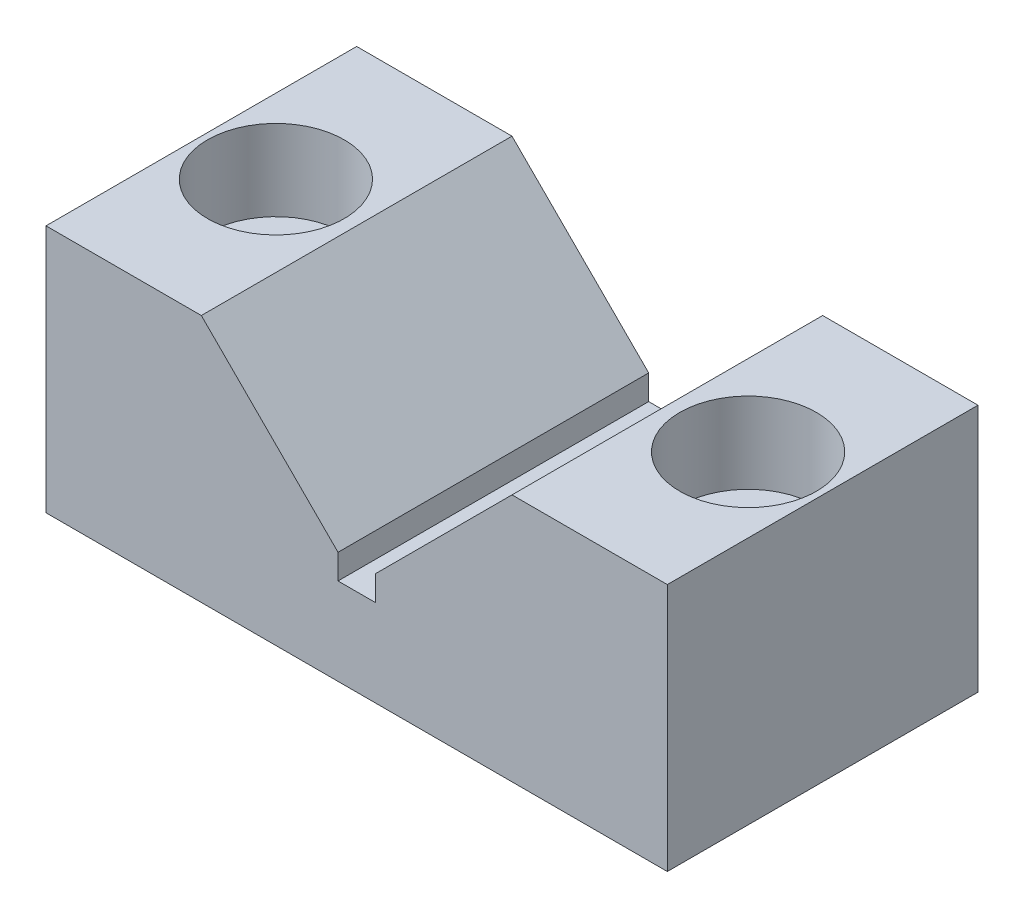
ISO-10303-21;
HEADER;
FILE_DESCRIPTION(('STEP AP214'),'2;1');
FILE_NAME('part.step','',(''),(''),'','','');
FILE_SCHEMA(('AUTOMOTIVE_DESIGN { 1 0 10303 214 1 1 1 1 }'));
ENDSEC;
DATA;
#1=APPLICATION_CONTEXT('core data for automotive mechanical design processes');
#2=APPLICATION_PROTOCOL_DEFINITION('international standard','automotive_design',2000,#1);
#3=PRODUCT_CONTEXT('',#1,'mechanical');
#4=PRODUCT('Part','Part','',(#3));
#5=PRODUCT_RELATED_PRODUCT_CATEGORY('part','',(#4));
#6=PRODUCT_DEFINITION_FORMATION('','',#4);
#7=PRODUCT_DEFINITION_CONTEXT('part definition',#1,'design');
#8=PRODUCT_DEFINITION('design','',#6,#7);
#9=PRODUCT_DEFINITION_SHAPE('','',#8);
#10=(LENGTH_UNIT() NAMED_UNIT(*) SI_UNIT(.MILLI.,.METRE.));
#11=(NAMED_UNIT(*) PLANE_ANGLE_UNIT() SI_UNIT($,.RADIAN.));
#12=(NAMED_UNIT(*) SI_UNIT($,.STERADIAN.) SOLID_ANGLE_UNIT());
#13=UNCERTAINTY_MEASURE_WITH_UNIT(LENGTH_MEASURE(1.E-05),#10,'distance_accuracy_value','');
#14=(GEOMETRIC_REPRESENTATION_CONTEXT(3) GLOBAL_UNCERTAINTY_ASSIGNED_CONTEXT((#13)) GLOBAL_UNIT_ASSIGNED_CONTEXT((#10,
#11,#12)) REPRESENTATION_CONTEXT('',''));
#15=CARTESIAN_POINT('',(0.,0.,0.));
#16=DIRECTION('',(0.,0.,1.));
#17=DIRECTION('',(1.,0.,0.));
#18=AXIS2_PLACEMENT_3D('',#15,#16,#17);
#19=CARTESIAN_POINT('',(19.,0.,0.));
#20=DIRECTION('',(0.,1.,0.));
#21=DIRECTION('',(-1.,0.,0.));
#22=AXIS2_PLACEMENT_3D('',#19,#20,#21);
#23=CYLINDRICAL_SURFACE('',#22,3.25);
#24=CARTESIAN_POINT('',(19.,0.,0.));
#25=DIRECTION('',(0.,1.,0.));
#26=DIRECTION('',(-1.,0.,0.));
#27=AXIS2_PLACEMENT_3D('',#24,#25,#26);
#28=CIRCLE('',#27,3.25);
#29=CARTESIAN_POINT('',(15.75,0.,0.));
#30=VERTEX_POINT('',#29);
#31=EDGE_CURVE('E132',#30,#30,#28,.T.);
#32=ORIENTED_EDGE('',*,*,#31,.F.);
#33=EDGE_LOOP('',(#32));
#34=FACE_BOUND('',#33,.T.);
#35=CARTESIAN_POINT('',(19.,13.5,0.));
#36=DIRECTION('',(0.,1.,0.));
#37=DIRECTION('',(-1.,0.,0.));
#38=AXIS2_PLACEMENT_3D('',#35,#36,#37);
#39=CIRCLE('',#38,3.25);
#40=CARTESIAN_POINT('',(15.75,13.5,0.));
#41=VERTEX_POINT('',#40);
#42=EDGE_CURVE('E35',#41,#41,#39,.F.);
#43=ORIENTED_EDGE('',*,*,#42,.F.);
#44=EDGE_LOOP('',(#43));
#45=FACE_BOUND('',#44,.T.);
#46=ADVANCED_FACE('F31',(#34,#45),#23,.F.);
#47=CARTESIAN_POINT('',(-19.,0.,0.));
#48=DIRECTION('',(0.,1.,0.));
#49=DIRECTION('',(-1.,0.,0.));
#50=AXIS2_PLACEMENT_3D('',#47,#48,#49);
#51=CYLINDRICAL_SURFACE('',#50,3.25);
#52=CARTESIAN_POINT('',(-19.,0.,0.));
#53=DIRECTION('',(0.,1.,0.));
#54=DIRECTION('',(-1.,0.,0.));
#55=AXIS2_PLACEMENT_3D('',#52,#53,#54);
#56=CIRCLE('',#55,3.25);
#57=CARTESIAN_POINT('',(-22.25,0.,0.));
#58=VERTEX_POINT('',#57);
#59=EDGE_CURVE('E129',#58,#58,#56,.T.);
#60=ORIENTED_EDGE('',*,*,#59,.F.);
#61=EDGE_LOOP('',(#60));
#62=FACE_BOUND('',#61,.T.);
#63=CARTESIAN_POINT('',(-19.,13.5,0.));
#64=DIRECTION('',(0.,1.,0.));
#65=DIRECTION('',(-1.,0.,0.));
#66=AXIS2_PLACEMENT_3D('',#63,#64,#65);
#67=CIRCLE('',#66,3.25);
#68=CARTESIAN_POINT('',(-22.25,13.5,0.));
#69=VERTEX_POINT('',#68);
#70=EDGE_CURVE('E192',#69,#69,#67,.F.);
#71=ORIENTED_EDGE('',*,*,#70,.F.);
#72=EDGE_LOOP('',(#71));
#73=FACE_BOUND('',#72,.T.);
#74=ADVANCED_FACE('F219',(#62,#73),#51,.F.);
#75=CARTESIAN_POINT('',(25.,0.,-12.5));
#76=DIRECTION('',(1.,0.,0.));
#77=DIRECTION('',(0.,1.,0.));
#78=AXIS2_PLACEMENT_3D('',#75,#76,#77);
#79=PLANE('',#78);
#80=DIRECTION('',(0.,0.,1.));
#81=VECTOR('',#80,1.);
#82=CARTESIAN_POINT('',(25.,20.,-12.5));
#83=LINE('',#82,#81);
#84=CARTESIAN_POINT('',(25.,20.,-12.5));
#85=VERTEX_POINT('',#84);
#86=CARTESIAN_POINT('',(25.,20.,12.5));
#87=VERTEX_POINT('',#86);
#88=EDGE_CURVE('E106',#85,#87,#83,.T.);
#89=ORIENTED_EDGE('',*,*,#88,.T.);
#90=DIRECTION('',(0.,1.,0.));
#91=VECTOR('',#90,1.);
#92=CARTESIAN_POINT('',(25.,0.,12.5));
#93=LINE('',#92,#91);
#94=CARTESIAN_POINT('',(25.,0.,12.5));
#95=VERTEX_POINT('',#94);
#96=EDGE_CURVE('E109',#95,#87,#93,.T.);
#97=ORIENTED_EDGE('',*,*,#96,.F.);
#98=DIRECTION('',(0.,0.,1.));
#99=VECTOR('',#98,1.);
#100=CARTESIAN_POINT('',(25.,0.,-12.5));
#101=LINE('',#100,#99);
#102=CARTESIAN_POINT('',(25.,0.,-12.5));
#103=VERTEX_POINT('',#102);
#104=EDGE_CURVE('E11',#103,#95,#101,.T.);
#105=ORIENTED_EDGE('',*,*,#104,.F.);
#106=DIRECTION('',(0.,1.,0.));
#107=VECTOR('',#106,1.);
#108=CARTESIAN_POINT('',(25.,0.,-12.5));
#109=LINE('',#108,#107);
#110=EDGE_CURVE('E110',#103,#85,#109,.T.);
#111=ORIENTED_EDGE('',*,*,#110,.T.);
#112=EDGE_LOOP('',(#89,#97,#105,#111));
#113=FACE_BOUND('',#112,.T.);
#114=ADVANCED_FACE('F33',(#113),#79,.T.);
#115=CARTESIAN_POINT('',(-25.,0.,-12.5));
#116=DIRECTION('',(0.,-1.,0.));
#117=DIRECTION('',(0.,0.,-1.));
#118=AXIS2_PLACEMENT_3D('',#115,#116,#117);
#119=PLANE('',#118);
#120=ORIENTED_EDGE('',*,*,#31,.T.);
#121=EDGE_LOOP('',(#120));
#122=FACE_BOUND('',#121,.T.);
#123=ORIENTED_EDGE('',*,*,#59,.T.);
#124=EDGE_LOOP('',(#123));
#125=FACE_BOUND('',#124,.T.);
#126=ORIENTED_EDGE('',*,*,#104,.T.);
#127=DIRECTION('',(1.,0.,0.));
#128=VECTOR('',#127,1.);
#129=CARTESIAN_POINT('',(-25.,0.,12.5));
#130=LINE('',#129,#128);
#131=CARTESIAN_POINT('',(-25.,0.,12.5));
#132=VERTEX_POINT('',#131);
#133=EDGE_CURVE('E128',#132,#95,#130,.T.);
#134=ORIENTED_EDGE('',*,*,#133,.F.);
#135=DIRECTION('',(0.,0.,1.));
#136=VECTOR('',#135,1.);
#137=CARTESIAN_POINT('',(-25.,0.,-12.5));
#138=LINE('',#137,#136);
#139=CARTESIAN_POINT('',(-25.,0.,-12.5));
#140=VERTEX_POINT('',#139);
#141=EDGE_CURVE('E40',#140,#132,#138,.T.);
#142=ORIENTED_EDGE('',*,*,#141,.F.);
#143=DIRECTION('',(1.,0.,0.));
#144=VECTOR('',#143,1.);
#145=CARTESIAN_POINT('',(-25.,0.,-12.5));
#146=LINE('',#145,#144);
#147=EDGE_CURVE('E115',#140,#103,#146,.T.);
#148=ORIENTED_EDGE('',*,*,#147,.T.);
#149=EDGE_LOOP('',(#126,#134,#142,#148));
#150=FACE_BOUND('',#149,.T.);
#151=ADVANCED_FACE('F239',(#122,#125,#150),#119,.T.);
#152=CARTESIAN_POINT('',(-25.,20.,-12.5));
#153=DIRECTION('',(-1.,0.,0.));
#154=DIRECTION('',(0.,-1.,0.));
#155=AXIS2_PLACEMENT_3D('',#152,#153,#154);
#156=PLANE('',#155);
#157=ORIENTED_EDGE('',*,*,#141,.T.);
#158=DIRECTION('',(0.,-1.,0.));
#159=VECTOR('',#158,1.);
#160=CARTESIAN_POINT('',(-25.,20.,12.5));
#161=LINE('',#160,#159);
#162=CARTESIAN_POINT('',(-25.,20.,12.5));
#163=VERTEX_POINT('',#162);
#164=EDGE_CURVE('E152',#163,#132,#161,.T.);
#165=ORIENTED_EDGE('',*,*,#164,.F.);
#166=DIRECTION('',(0.,0.,1.));
#167=VECTOR('',#166,1.);
#168=CARTESIAN_POINT('',(-25.,20.,-12.5));
#169=LINE('',#168,#167);
#170=CARTESIAN_POINT('',(-25.,20.,-12.5));
#171=VERTEX_POINT('',#170);
#172=EDGE_CURVE('E180',#171,#163,#169,.T.);
#173=ORIENTED_EDGE('',*,*,#172,.F.);
#174=DIRECTION('',(0.,-1.,0.));
#175=VECTOR('',#174,1.);
#176=CARTESIAN_POINT('',(-25.,20.,-12.5));
#177=LINE('',#176,#175);
#178=EDGE_CURVE('E176',#171,#140,#177,.T.);
#179=ORIENTED_EDGE('',*,*,#178,.T.);
#180=EDGE_LOOP('',(#157,#165,#173,#179));
#181=FACE_BOUND('',#180,.T.);
#182=ADVANCED_FACE('F242',(#181),#156,.T.);
#183=CARTESIAN_POINT('',(-12.5,20.,-12.5));
#184=DIRECTION('',(0.,1.,0.));
#185=DIRECTION('',(-1.,0.,0.));
#186=AXIS2_PLACEMENT_3D('',#183,#184,#185);
#187=PLANE('',#186);
#188=CARTESIAN_POINT('',(-19.,20.,0.));
#189=DIRECTION('',(0.,1.,0.));
#190=DIRECTION('',(-1.,0.,0.));
#191=AXIS2_PLACEMENT_3D('',#188,#189,#190);
#192=CIRCLE('',#191,5.5);
#193=CARTESIAN_POINT('',(-24.5,20.,0.));
#194=VERTEX_POINT('',#193);
#195=EDGE_CURVE('E199',#194,#194,#192,.T.);
#196=ORIENTED_EDGE('',*,*,#195,.F.);
#197=EDGE_LOOP('',(#196));
#198=FACE_BOUND('',#197,.T.);
#199=ORIENTED_EDGE('',*,*,#172,.T.);
#200=DIRECTION('',(-1.,0.,0.));
#201=VECTOR('',#200,1.);
#202=CARTESIAN_POINT('',(-12.5,20.,12.5));
#203=LINE('',#202,#201);
#204=CARTESIAN_POINT('',(-12.5,20.,12.5));
#205=VERTEX_POINT('',#204);
#206=EDGE_CURVE('E149',#205,#163,#203,.T.);
#207=ORIENTED_EDGE('',*,*,#206,.F.);
#208=DIRECTION('',(0.,0.,1.));
#209=VECTOR('',#208,1.);
#210=CARTESIAN_POINT('',(-12.5,20.,-12.5));
#211=LINE('',#210,#209);
#212=CARTESIAN_POINT('',(-12.5,20.,-12.5));
#213=VERTEX_POINT('',#212);
#214=EDGE_CURVE('E182',#213,#205,#211,.T.);
#215=ORIENTED_EDGE('',*,*,#214,.F.);
#216=DIRECTION('',(-1.,0.,0.));
#217=VECTOR('',#216,1.);
#218=CARTESIAN_POINT('',(-12.5,20.,-12.5));
#219=LINE('',#218,#217);
#220=EDGE_CURVE('E173',#213,#171,#219,.T.);
#221=ORIENTED_EDGE('',*,*,#220,.T.);
#222=EDGE_LOOP('',(#199,#207,#215,#221));
#223=FACE_BOUND('',#222,.T.);
#224=ADVANCED_FACE('F246',(#198,#223),#187,.T.);
#225=CARTESIAN_POINT('',(-1.5,9.,-12.5));
#226=DIRECTION('',(0.707106781186547,0.707106781186548,0.));
#227=DIRECTION('',(-0.707106781186548,0.707106781186547,0.));
#228=AXIS2_PLACEMENT_3D('',#225,#226,#227);
#229=PLANE('',#228);
#230=ORIENTED_EDGE('',*,*,#214,.T.);
#231=DIRECTION('',(-0.707106781186548,0.707106781186547,0.));
#232=VECTOR('',#231,1.);
#233=CARTESIAN_POINT('',(-1.5,9.,12.5));
#234=LINE('',#233,#232);
#235=CARTESIAN_POINT('',(-1.5,9.,12.5));
#236=VERTEX_POINT('',#235);
#237=EDGE_CURVE('E146',#236,#205,#234,.T.);
#238=ORIENTED_EDGE('',*,*,#237,.F.);
#239=DIRECTION('',(0.,0.,1.));
#240=VECTOR('',#239,1.);
#241=CARTESIAN_POINT('',(-1.5,9.,-12.5));
#242=LINE('',#241,#240);
#243=CARTESIAN_POINT('',(-1.5,9.,-12.5));
#244=VERTEX_POINT('',#243);
#245=EDGE_CURVE('E184',#244,#236,#242,.T.);
#246=ORIENTED_EDGE('',*,*,#245,.F.);
#247=DIRECTION('',(-0.707106781186548,0.707106781186547,0.));
#248=VECTOR('',#247,1.);
#249=CARTESIAN_POINT('',(-1.5,9.,-12.5));
#250=LINE('',#249,#248);
#251=EDGE_CURVE('E170',#244,#213,#250,.T.);
#252=ORIENTED_EDGE('',*,*,#251,.T.);
#253=EDGE_LOOP('',(#230,#238,#246,#252));
#254=FACE_BOUND('',#253,.T.);
#255=ADVANCED_FACE('F250',(#254),#229,.T.);
#256=CARTESIAN_POINT('',(-1.5,7.,-12.5));
#257=DIRECTION('',(1.,0.,0.));
#258=DIRECTION('',(0.,0.,-1.));
#259=AXIS2_PLACEMENT_3D('',#256,#257,#258);
#260=PLANE('',#259);
#261=ORIENTED_EDGE('',*,*,#245,.T.);
#262=DIRECTION('',(0.,1.,0.));
#263=VECTOR('',#262,1.);
#264=CARTESIAN_POINT('',(-1.5,7.,12.5));
#265=LINE('',#264,#263);
#266=CARTESIAN_POINT('',(-1.5,7.,12.5));
#267=VERTEX_POINT('',#266);
#268=EDGE_CURVE('E143',#267,#236,#265,.T.);
#269=ORIENTED_EDGE('',*,*,#268,.F.);
#270=DIRECTION('',(0.,0.,1.));
#271=VECTOR('',#270,1.);
#272=CARTESIAN_POINT('',(-1.5,7.,-12.5));
#273=LINE('',#272,#271);
#274=CARTESIAN_POINT('',(-1.5,7.,-12.5));
#275=VERTEX_POINT('',#274);
#276=EDGE_CURVE('E186',#275,#267,#273,.T.);
#277=ORIENTED_EDGE('',*,*,#276,.F.);
#278=DIRECTION('',(0.,1.,0.));
#279=VECTOR('',#278,1.);
#280=CARTESIAN_POINT('',(-1.5,7.,-12.5));
#281=LINE('',#280,#279);
#282=EDGE_CURVE('E167',#275,#244,#281,.T.);
#283=ORIENTED_EDGE('',*,*,#282,.T.);
#284=EDGE_LOOP('',(#261,#269,#277,#283));
#285=FACE_BOUND('',#284,.T.);
#286=ADVANCED_FACE('F254',(#285),#260,.T.);
#287=CARTESIAN_POINT('',(1.5,7.,-12.5));
#288=DIRECTION('',(0.,1.,0.));
#289=DIRECTION('',(0.,0.,1.));
#290=AXIS2_PLACEMENT_3D('',#287,#288,#289);
#291=PLANE('',#290);
#292=ORIENTED_EDGE('',*,*,#276,.T.);
#293=DIRECTION('',(-1.,0.,0.));
#294=VECTOR('',#293,1.);
#295=CARTESIAN_POINT('',(1.5,7.,12.5));
#296=LINE('',#295,#294);
#297=CARTESIAN_POINT('',(1.5,7.,12.5));
#298=VERTEX_POINT('',#297);
#299=EDGE_CURVE('E140',#298,#267,#296,.T.);
#300=ORIENTED_EDGE('',*,*,#299,.F.);
#301=DIRECTION('',(0.,0.,1.));
#302=VECTOR('',#301,1.);
#303=CARTESIAN_POINT('',(1.5,7.,-12.5));
#304=LINE('',#303,#302);
#305=CARTESIAN_POINT('',(1.5,7.,-12.5));
#306=VERTEX_POINT('',#305);
#307=EDGE_CURVE('E188',#306,#298,#304,.T.);
#308=ORIENTED_EDGE('',*,*,#307,.F.);
#309=DIRECTION('',(-1.,0.,0.));
#310=VECTOR('',#309,1.);
#311=CARTESIAN_POINT('',(1.5,7.,-12.5));
#312=LINE('',#311,#310);
#313=EDGE_CURVE('E164',#306,#275,#312,.T.);
#314=ORIENTED_EDGE('',*,*,#313,.T.);
#315=EDGE_LOOP('',(#292,#300,#308,#314));
#316=FACE_BOUND('',#315,.T.);
#317=ADVANCED_FACE('F258',(#316),#291,.T.);
#318=CARTESIAN_POINT('',(1.5,9.,-12.5));
#319=DIRECTION('',(-1.,0.,0.));
#320=DIRECTION('',(0.,0.,1.));
#321=AXIS2_PLACEMENT_3D('',#318,#319,#320);
#322=PLANE('',#321);
#323=ORIENTED_EDGE('',*,*,#307,.T.);
#324=DIRECTION('',(0.,-1.,0.));
#325=VECTOR('',#324,1.);
#326=CARTESIAN_POINT('',(1.5,9.,12.5));
#327=LINE('',#326,#325);
#328=CARTESIAN_POINT('',(1.5,9.,12.5));
#329=VERTEX_POINT('',#328);
#330=EDGE_CURVE('E137',#329,#298,#327,.T.);
#331=ORIENTED_EDGE('',*,*,#330,.F.);
#332=DIRECTION('',(0.,0.,1.));
#333=VECTOR('',#332,1.);
#334=CARTESIAN_POINT('',(1.5,9.,-12.5));
#335=LINE('',#334,#333);
#336=CARTESIAN_POINT('',(1.5,9.,-12.5));
#337=VERTEX_POINT('',#336);
#338=EDGE_CURVE('E190',#337,#329,#335,.T.);
#339=ORIENTED_EDGE('',*,*,#338,.F.);
#340=DIRECTION('',(0.,-1.,0.));
#341=VECTOR('',#340,1.);
#342=CARTESIAN_POINT('',(1.5,9.,-12.5));
#343=LINE('',#342,#341);
#344=EDGE_CURVE('E161',#337,#306,#343,.T.);
#345=ORIENTED_EDGE('',*,*,#344,.T.);
#346=EDGE_LOOP('',(#323,#331,#339,#345));
#347=FACE_BOUND('',#346,.T.);
#348=ADVANCED_FACE('F262',(#347),#322,.T.);
#349=CARTESIAN_POINT('',(12.5,20.,-12.5));
#350=DIRECTION('',(-0.707106781186547,0.707106781186548,0.));
#351=DIRECTION('',(-0.707106781186548,-0.707106781186547,0.));
#352=AXIS2_PLACEMENT_3D('',#349,#350,#351);
#353=PLANE('',#352);
#354=ORIENTED_EDGE('',*,*,#338,.T.);
#355=DIRECTION('',(-0.707106781186548,-0.707106781186547,0.));
#356=VECTOR('',#355,1.);
#357=CARTESIAN_POINT('',(12.5,20.,12.5));
#358=LINE('',#357,#356);
#359=CARTESIAN_POINT('',(12.5,20.,12.5));
#360=VERTEX_POINT('',#359);
#361=EDGE_CURVE('E123',#360,#329,#358,.T.);
#362=ORIENTED_EDGE('',*,*,#361,.F.);
#363=DIRECTION('',(0.,0.,1.));
#364=VECTOR('',#363,1.);
#365=CARTESIAN_POINT('',(12.5,20.,-12.5));
#366=LINE('',#365,#364);
#367=CARTESIAN_POINT('',(12.5,20.,-12.5));
#368=VERTEX_POINT('',#367);
#369=EDGE_CURVE('E114',#368,#360,#366,.T.);
#370=ORIENTED_EDGE('',*,*,#369,.F.);
#371=DIRECTION('',(-0.707106781186548,-0.707106781186547,0.));
#372=VECTOR('',#371,1.);
#373=CARTESIAN_POINT('',(12.5,20.,-12.5));
#374=LINE('',#373,#372);
#375=EDGE_CURVE('E158',#368,#337,#374,.T.);
#376=ORIENTED_EDGE('',*,*,#375,.T.);
#377=EDGE_LOOP('',(#354,#362,#370,#376));
#378=FACE_BOUND('',#377,.T.);
#379=ADVANCED_FACE('F266',(#378),#353,.T.);
#380=CARTESIAN_POINT('',(25.,20.,-12.5));
#381=DIRECTION('',(0.,1.,0.));
#382=DIRECTION('',(-1.,0.,0.));
#383=AXIS2_PLACEMENT_3D('',#380,#381,#382);
#384=PLANE('',#383);
#385=CARTESIAN_POINT('',(19.,20.,0.));
#386=DIRECTION('',(0.,1.,0.));
#387=DIRECTION('',(-1.,0.,0.));
#388=AXIS2_PLACEMENT_3D('',#385,#386,#387);
#389=CIRCLE('',#388,5.5);
#390=CARTESIAN_POINT('',(13.5,20.,0.));
#391=VERTEX_POINT('',#390);
#392=EDGE_CURVE('E206',#391,#391,#389,.T.);
#393=ORIENTED_EDGE('',*,*,#392,.F.);
#394=EDGE_LOOP('',(#393));
#395=FACE_BOUND('',#394,.T.);
#396=ORIENTED_EDGE('',*,*,#369,.T.);
#397=DIRECTION('',(-1.,0.,0.));
#398=VECTOR('',#397,1.);
#399=CARTESIAN_POINT('',(25.,20.,12.5));
#400=LINE('',#399,#398);
#401=EDGE_CURVE('E118',#87,#360,#400,.T.);
#402=ORIENTED_EDGE('',*,*,#401,.F.);
#403=ORIENTED_EDGE('',*,*,#88,.F.);
#404=DIRECTION('',(-1.,0.,0.));
#405=VECTOR('',#404,1.);
#406=CARTESIAN_POINT('',(25.,20.,-12.5));
#407=LINE('',#406,#405);
#408=EDGE_CURVE('E156',#85,#368,#407,.T.);
#409=ORIENTED_EDGE('',*,*,#408,.T.);
#410=EDGE_LOOP('',(#396,#402,#403,#409));
#411=FACE_BOUND('',#410,.T.);
#412=ADVANCED_FACE('F119',(#395,#411),#384,.T.);
#413=CARTESIAN_POINT('',(25.,20.,-12.5));
#414=DIRECTION('',(0.,0.,1.));
#415=DIRECTION('',(1.,0.,0.));
#416=AXIS2_PLACEMENT_3D('',#413,#414,#415);
#417=PLANE('',#416);
#418=ORIENTED_EDGE('',*,*,#110,.F.);
#419=ORIENTED_EDGE('',*,*,#147,.F.);
#420=ORIENTED_EDGE('',*,*,#178,.F.);
#421=ORIENTED_EDGE('',*,*,#220,.F.);
#422=ORIENTED_EDGE('',*,*,#251,.F.);
#423=ORIENTED_EDGE('',*,*,#282,.F.);
#424=ORIENTED_EDGE('',*,*,#313,.F.);
#425=ORIENTED_EDGE('',*,*,#344,.F.);
#426=ORIENTED_EDGE('',*,*,#375,.F.);
#427=ORIENTED_EDGE('',*,*,#408,.F.);
#428=EDGE_LOOP('',(#418,#419,#420,#421,#422,#423,#424,#425,#426,#427));
#429=FACE_BOUND('',#428,.T.);
#430=ADVANCED_FACE('F235',(#429),#417,.F.);
#431=CARTESIAN_POINT('',(25.,20.,12.5));
#432=DIRECTION('',(0.,0.,1.));
#433=DIRECTION('',(1.,0.,0.));
#434=AXIS2_PLACEMENT_3D('',#431,#432,#433);
#435=PLANE('',#434);
#436=ORIENTED_EDGE('',*,*,#96,.T.);
#437=ORIENTED_EDGE('',*,*,#401,.T.);
#438=ORIENTED_EDGE('',*,*,#361,.T.);
#439=ORIENTED_EDGE('',*,*,#330,.T.);
#440=ORIENTED_EDGE('',*,*,#299,.T.);
#441=ORIENTED_EDGE('',*,*,#268,.T.);
#442=ORIENTED_EDGE('',*,*,#237,.T.);
#443=ORIENTED_EDGE('',*,*,#206,.T.);
#444=ORIENTED_EDGE('',*,*,#164,.T.);
#445=ORIENTED_EDGE('',*,*,#133,.T.);
#446=EDGE_LOOP('',(#436,#437,#438,#439,#440,#441,#442,#443,#444,#445));
#447=FACE_BOUND('',#446,.T.);
#448=ADVANCED_FACE('F126',(#447),#435,.T.);
#449=CARTESIAN_POINT('',(-19.,13.5,0.));
#450=DIRECTION('',(0.,1.,0.));
#451=DIRECTION('',(-1.,0.,0.));
#452=AXIS2_PLACEMENT_3D('',#449,#450,#451);
#453=PLANE('',#452);
#454=CARTESIAN_POINT('',(-19.,13.5,0.));
#455=DIRECTION('',(0.,1.,0.));
#456=DIRECTION('',(-1.,0.,0.));
#457=AXIS2_PLACEMENT_3D('',#454,#455,#456);
#458=CIRCLE('',#457,5.5);
#459=CARTESIAN_POINT('',(-24.5,13.5,0.));
#460=VERTEX_POINT('',#459);
#461=EDGE_CURVE('E194',#460,#460,#458,.T.);
#462=ORIENTED_EDGE('',*,*,#461,.T.);
#463=EDGE_LOOP('',(#462));
#464=FACE_BOUND('',#463,.T.);
#465=ORIENTED_EDGE('',*,*,#70,.T.);
#466=EDGE_LOOP('',(#465));
#467=FACE_BOUND('',#466,.T.);
#468=ADVANCED_FACE('F234',(#464,#467),#453,.T.);
#469=CARTESIAN_POINT('',(-19.,13.5,0.));
#470=DIRECTION('',(0.,1.,0.));
#471=DIRECTION('',(-1.,0.,0.));
#472=AXIS2_PLACEMENT_3D('',#469,#470,#471);
#473=CYLINDRICAL_SURFACE('',#472,5.5);
#474=ORIENTED_EDGE('',*,*,#461,.F.);
#475=EDGE_LOOP('',(#474));
#476=FACE_BOUND('',#475,.T.);
#477=ORIENTED_EDGE('',*,*,#195,.T.);
#478=EDGE_LOOP('',(#477));
#479=FACE_BOUND('',#478,.T.);
#480=ADVANCED_FACE('F229',(#476,#479),#473,.F.);
#481=CARTESIAN_POINT('',(19.,13.5,0.));
#482=DIRECTION('',(0.,1.,0.));
#483=DIRECTION('',(-1.,0.,0.));
#484=AXIS2_PLACEMENT_3D('',#481,#482,#483);
#485=PLANE('',#484);
#486=CARTESIAN_POINT('',(19.,13.5,0.));
#487=DIRECTION('',(0.,1.,0.));
#488=DIRECTION('',(-1.,0.,0.));
#489=AXIS2_PLACEMENT_3D('',#486,#487,#488);
#490=CIRCLE('',#489,5.5);
#491=CARTESIAN_POINT('',(13.5,13.5,0.));
#492=VERTEX_POINT('',#491);
#493=EDGE_CURVE('E209',#492,#492,#490,.T.);
#494=ORIENTED_EDGE('',*,*,#493,.T.);
#495=EDGE_LOOP('',(#494));
#496=FACE_BOUND('',#495,.T.);
#497=ORIENTED_EDGE('',*,*,#42,.T.);
#498=EDGE_LOOP('',(#497));
#499=FACE_BOUND('',#498,.T.);
#500=ADVANCED_FACE('F216',(#496,#499),#485,.T.);
#501=CARTESIAN_POINT('',(19.,13.5,0.));
#502=DIRECTION('',(0.,1.,0.));
#503=DIRECTION('',(-1.,0.,0.));
#504=AXIS2_PLACEMENT_3D('',#501,#502,#503);
#505=CYLINDRICAL_SURFACE('',#504,5.5);
#506=ORIENTED_EDGE('',*,*,#493,.F.);
#507=EDGE_LOOP('',(#506));
#508=FACE_BOUND('',#507,.T.);
#509=ORIENTED_EDGE('',*,*,#392,.T.);
#510=EDGE_LOOP('',(#509));
#511=FACE_BOUND('',#510,.T.);
#512=ADVANCED_FACE('F276',(#508,#511),#505,.F.);
#513=CLOSED_SHELL('',(#46,#74,#114,#151,#182,#224,#255,#286,#317,#348,#379,#412,#430,#448,#468,
#480,#500,#512));
#514=MANIFOLD_SOLID_BREP('B2',#513);
#515=ADVANCED_BREP_SHAPE_REPRESENTATION('',(#18,#514),#14);
#516=SHAPE_DEFINITION_REPRESENTATION(#9,#515);
ENDSEC;
END-ISO-10303-21;
